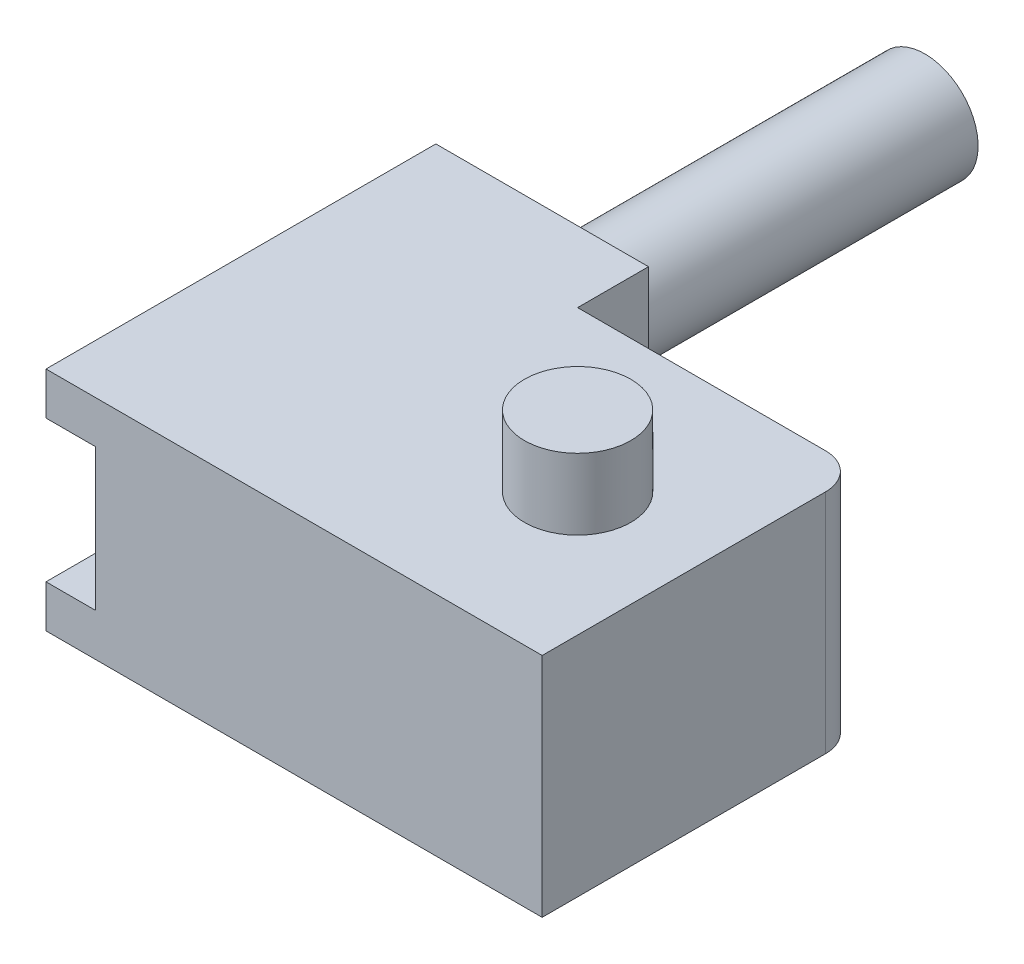
ISO-10303-21;
HEADER;
FILE_DESCRIPTION(('STEP AP214'),'2;1');
FILE_NAME('part.step','',(''),(''),'','','');
FILE_SCHEMA(('AUTOMOTIVE_DESIGN { 1 0 10303 214 1 1 1 1 }'));
ENDSEC;
DATA;
#1=APPLICATION_CONTEXT('core data for automotive mechanical design processes');
#2=APPLICATION_PROTOCOL_DEFINITION('international standard','automotive_design',2000,#1);
#3=PRODUCT_CONTEXT('',#1,'mechanical');
#4=PRODUCT('Part','Part','',(#3));
#5=PRODUCT_RELATED_PRODUCT_CATEGORY('part','',(#4));
#6=PRODUCT_DEFINITION_FORMATION('','',#4);
#7=PRODUCT_DEFINITION_CONTEXT('part definition',#1,'design');
#8=PRODUCT_DEFINITION('design','',#6,#7);
#9=PRODUCT_DEFINITION_SHAPE('','',#8);
#10=(LENGTH_UNIT() NAMED_UNIT(*) SI_UNIT(.MILLI.,.METRE.));
#11=(NAMED_UNIT(*) PLANE_ANGLE_UNIT() SI_UNIT($,.RADIAN.));
#12=(NAMED_UNIT(*) SI_UNIT($,.STERADIAN.) SOLID_ANGLE_UNIT());
#13=UNCERTAINTY_MEASURE_WITH_UNIT(LENGTH_MEASURE(1.E-05),#10,'distance_accuracy_value','');
#14=(GEOMETRIC_REPRESENTATION_CONTEXT(3) GLOBAL_UNCERTAINTY_ASSIGNED_CONTEXT((#13)) GLOBAL_UNIT_ASSIGNED_CONTEXT((#10,
#11,#12)) REPRESENTATION_CONTEXT('',''));
#15=CARTESIAN_POINT('',(0.,0.,0.));
#16=DIRECTION('',(0.,0.,1.));
#17=DIRECTION('',(1.,0.,0.));
#18=AXIS2_PLACEMENT_3D('',#15,#16,#17);
#19=CARTESIAN_POINT('',(52.5,-30.,22.5));
#20=DIRECTION('',(0.,1.,0.));
#21=DIRECTION('',(0.,0.,1.));
#22=AXIS2_PLACEMENT_3D('',#19,#20,#21);
#23=CYLINDRICAL_SURFACE('',#22,7.5);
#24=CARTESIAN_POINT('',(52.5,3.99999999999999,22.5));
#25=DIRECTION('',(0.,1.,0.));
#26=DIRECTION('',(-1.,0.,0.));
#27=AXIS2_PLACEMENT_3D('',#24,#25,#26);
#28=CIRCLE('',#27,7.5);
#29=CARTESIAN_POINT('',(45.,3.99999999999999,22.5));
#30=VERTEX_POINT('',#29);
#31=EDGE_CURVE('E205',#30,#30,#28,.T.);
#32=ORIENTED_EDGE('',*,*,#31,.F.);
#33=EDGE_LOOP('',(#32));
#34=FACE_BOUND('',#33,.T.);
#35=CARTESIAN_POINT('',(52.5,-6.,22.5));
#36=DIRECTION('',(0.,-1.,0.));
#37=DIRECTION('',(0.,0.,-1.));
#38=AXIS2_PLACEMENT_3D('',#35,#36,#37);
#39=CIRCLE('',#38,7.5);
#40=CARTESIAN_POINT('',(52.5,-6.,15.));
#41=VERTEX_POINT('',#40);
#42=EDGE_CURVE('E362',#41,#41,#39,.F.);
#43=ORIENTED_EDGE('',*,*,#42,.T.);
#44=EDGE_LOOP('',(#43));
#45=FACE_BOUND('',#44,.T.);
#46=ADVANCED_FACE('F33',(#34,#45),#23,.T.);
#47=CARTESIAN_POINT('',(47.5,0.,39.));
#48=DIRECTION('',(-1.,0.,0.));
#49=DIRECTION('',(0.,0.,1.));
#50=AXIS2_PLACEMENT_3D('',#47,#48,#49);
#51=PLANE('',#50);
#52=DIRECTION('',(0.,1.,0.));
#53=VECTOR('',#52,1.);
#54=CARTESIAN_POINT('',(47.5,-30.,28.0901699437495));
#55=LINE('',#54,#53);
#56=CARTESIAN_POINT('',(47.5,9.99999999999999,28.0901699437495));
#57=VERTEX_POINT('',#56);
#58=CARTESIAN_POINT('',(47.5,30.,28.0901699437495));
#59=VERTEX_POINT('',#58);
#60=EDGE_CURVE('E199',#57,#59,#55,.T.);
#61=ORIENTED_EDGE('',*,*,#60,.F.);
#62=DIRECTION('',(0.,0.,-1.));
#63=VECTOR('',#62,1.);
#64=CARTESIAN_POINT('',(47.5,9.99999999999999,39.));
#65=LINE('',#64,#63);
#66=CARTESIAN_POINT('',(47.5,9.99999999999999,39.));
#67=VERTEX_POINT('',#66);
#68=EDGE_CURVE('E185',#67,#57,#65,.T.);
#69=ORIENTED_EDGE('',*,*,#68,.F.);
#70=DIRECTION('',(0.,1.,0.));
#71=VECTOR('',#70,1.);
#72=CARTESIAN_POINT('',(47.5,0.,39.));
#73=LINE('',#72,#71);
#74=CARTESIAN_POINT('',(47.5,30.,39.));
#75=VERTEX_POINT('',#74);
#76=EDGE_CURVE('E235',#67,#75,#73,.T.);
#77=ORIENTED_EDGE('',*,*,#76,.T.);
#78=DIRECTION('',(0.,0.,-1.));
#79=VECTOR('',#78,1.);
#80=CARTESIAN_POINT('',(47.5,30.,39.));
#81=LINE('',#80,#79);
#82=EDGE_CURVE('E201',#75,#59,#81,.T.);
#83=ORIENTED_EDGE('',*,*,#82,.T.);
#84=EDGE_LOOP('',(#61,#69,#77,#83));
#85=FACE_BOUND('',#84,.T.);
#86=ADVANCED_FACE('F200',(#85),#51,.T.);
#87=CARTESIAN_POINT('',(65.,40.,5.));
#88=DIRECTION('',(0.,-1.,0.));
#89=DIRECTION('',(0.,0.,-1.));
#90=AXIS2_PLACEMENT_3D('',#87,#88,#89);
#91=CYLINDRICAL_SURFACE('',#90,5.);
#92=DIRECTION('',(0.,1.,0.));
#93=VECTOR('',#92,1.);
#94=CARTESIAN_POINT('',(65.,40.,0.));
#95=LINE('',#94,#93);
#96=CARTESIAN_POINT('',(65.,36.,0.));
#97=VERTEX_POINT('',#96);
#98=CARTESIAN_POINT('',(65.,3.99999999999999,0.));
#99=VERTEX_POINT('',#98);
#100=EDGE_CURVE('E213',#97,#99,#95,.F.);
#101=ORIENTED_EDGE('',*,*,#100,.F.);
#102=CARTESIAN_POINT('',(65.,36.,5.));
#103=DIRECTION('',(0.,1.,0.));
#104=DIRECTION('',(-1.,0.,0.));
#105=AXIS2_PLACEMENT_3D('',#102,#103,#104);
#106=CIRCLE('',#105,5.);
#107=CARTESIAN_POINT('',(70.,36.,5.00000000000001));
#108=VERTEX_POINT('',#107);
#109=EDGE_CURVE('E212',#97,#108,#106,.F.);
#110=ORIENTED_EDGE('',*,*,#109,.T.);
#111=DIRECTION('',(0.,1.,0.));
#112=VECTOR('',#111,1.);
#113=CARTESIAN_POINT('',(70.,40.,5.));
#114=LINE('',#113,#112);
#115=CARTESIAN_POINT('',(70.,3.99999999999999,5.00000000000001));
#116=VERTEX_POINT('',#115);
#117=EDGE_CURVE('E218',#116,#108,#114,.T.);
#118=ORIENTED_EDGE('',*,*,#117,.F.);
#119=CARTESIAN_POINT('',(65.,3.99999999999999,5.));
#120=DIRECTION('',(0.,1.,0.));
#121=DIRECTION('',(-1.,0.,0.));
#122=AXIS2_PLACEMENT_3D('',#119,#120,#121);
#123=CIRCLE('',#122,5.);
#124=EDGE_CURVE('E340',#99,#116,#123,.F.);
#125=ORIENTED_EDGE('',*,*,#124,.F.);
#126=EDGE_LOOP('',(#101,#110,#118,#125));
#127=FACE_BOUND('',#126,.T.);
#128=ADVANCED_FACE('F461',(#127),#91,.T.);
#129=CARTESIAN_POINT('',(0.,0.,0.));
#130=DIRECTION('',(0.,0.,-1.));
#131=DIRECTION('',(-1.,0.,0.));
#132=AXIS2_PLACEMENT_3D('',#129,#130,#131);
#133=PLANE('',#132);
#134=DIRECTION('',(0.,-1.,0.));
#135=VECTOR('',#134,1.);
#136=CARTESIAN_POINT('',(30.,40.,0.));
#137=LINE('',#136,#135);
#138=CARTESIAN_POINT('',(30.,36.,0.));
#139=VERTEX_POINT('',#138);
#140=CARTESIAN_POINT('',(30.,30.,0.));
#141=VERTEX_POINT('',#140);
#142=EDGE_CURVE('E230',#139,#141,#137,.T.);
#143=ORIENTED_EDGE('',*,*,#142,.F.);
#144=DIRECTION('',(1.,0.,0.));
#145=VECTOR('',#144,1.);
#146=CARTESIAN_POINT('',(0.,36.,0.));
#147=LINE('',#146,#145);
#148=EDGE_CURVE('E217',#139,#97,#147,.T.);
#149=ORIENTED_EDGE('',*,*,#148,.T.);
#150=ORIENTED_EDGE('',*,*,#100,.T.);
#151=DIRECTION('',(1.,0.,0.));
#152=VECTOR('',#151,1.);
#153=CARTESIAN_POINT('',(0.,4.,0.));
#154=LINE('',#153,#152);
#155=CARTESIAN_POINT('',(30.,4.,0.));
#156=VERTEX_POINT('',#155);
#157=EDGE_CURVE('E352',#156,#99,#154,.T.);
#158=ORIENTED_EDGE('',*,*,#157,.F.);
#159=CARTESIAN_POINT('',(30.,10.,0.));
#160=VERTEX_POINT('',#159);
#161=EDGE_CURVE('E321',#160,#156,#137,.T.);
#162=ORIENTED_EDGE('',*,*,#161,.F.);
#163=DIRECTION('',(1.,0.,0.));
#164=VECTOR('',#163,1.);
#165=CARTESIAN_POINT('',(0.,10.,0.));
#166=LINE('',#165,#164);
#167=CARTESIAN_POINT('',(54.5,10.,0.));
#168=VERTEX_POINT('',#167);
#169=EDGE_CURVE('E216',#160,#168,#166,.T.);
#170=ORIENTED_EDGE('',*,*,#169,.T.);
#171=DIRECTION('',(0.,1.,0.));
#172=VECTOR('',#171,1.);
#173=CARTESIAN_POINT('',(54.5,10.,0.));
#174=LINE('',#173,#172);
#175=CARTESIAN_POINT('',(54.5,30.,0.));
#176=VERTEX_POINT('',#175);
#177=EDGE_CURVE('E272',#168,#176,#174,.T.);
#178=ORIENTED_EDGE('',*,*,#177,.T.);
#179=DIRECTION('',(1.,0.,0.));
#180=VECTOR('',#179,1.);
#181=CARTESIAN_POINT('',(0.,30.,0.));
#182=LINE('',#181,#180);
#183=EDGE_CURVE('E246',#141,#176,#182,.T.);
#184=ORIENTED_EDGE('',*,*,#183,.F.);
#185=EDGE_LOOP('',(#143,#149,#150,#158,#162,#170,#178,#184));
#186=FACE_BOUND('',#185,.T.);
#187=ADVANCED_FACE('F411',(#186),#133,.T.);
#188=CARTESIAN_POINT('',(70.,40.,45.));
#189=DIRECTION('',(-1.,0.,0.));
#190=DIRECTION('',(0.,0.,1.));
#191=AXIS2_PLACEMENT_3D('',#188,#189,#190);
#192=PLANE('',#191);
#193=DIRECTION('',(0.,0.,-1.));
#194=VECTOR('',#193,1.);
#195=CARTESIAN_POINT('',(70.,36.,45.));
#196=LINE('',#195,#194);
#197=CARTESIAN_POINT('',(70.,36.,45.));
#198=VERTEX_POINT('',#197);
#199=EDGE_CURVE('E339',#198,#108,#196,.T.);
#200=ORIENTED_EDGE('',*,*,#199,.F.);
#201=DIRECTION('',(0.,1.,0.));
#202=VECTOR('',#201,1.);
#203=CARTESIAN_POINT('',(70.,40.,45.));
#204=LINE('',#203,#202);
#205=CARTESIAN_POINT('',(70.,4.,45.));
#206=VERTEX_POINT('',#205);
#207=EDGE_CURVE('E228',#206,#198,#204,.T.);
#208=ORIENTED_EDGE('',*,*,#207,.F.);
#209=DIRECTION('',(0.,0.,-1.));
#210=VECTOR('',#209,1.);
#211=CARTESIAN_POINT('',(70.,4.,45.));
#212=LINE('',#211,#210);
#213=EDGE_CURVE('E222',#206,#116,#212,.T.);
#214=ORIENTED_EDGE('',*,*,#213,.T.);
#215=ORIENTED_EDGE('',*,*,#117,.T.);
#216=EDGE_LOOP('',(#200,#208,#214,#215));
#217=FACE_BOUND('',#216,.T.);
#218=ADVANCED_FACE('F386',(#217),#192,.F.);
#219=CARTESIAN_POINT('',(0.,0.,45.));
#220=DIRECTION('',(1.,0.,0.));
#221=DIRECTION('',(0.,0.,-1.));
#222=AXIS2_PLACEMENT_3D('',#219,#220,#221);
#223=PLANE('',#222);
#224=DIRECTION('',(0.,1.,0.));
#225=VECTOR('',#224,1.);
#226=CARTESIAN_POINT('',(0.,0.,0.));
#227=LINE('',#226,#225);
#228=CARTESIAN_POINT('',(0.,10.,0.));
#229=VERTEX_POINT('',#228);
#230=CARTESIAN_POINT('',(0.,30.,0.));
#231=VERTEX_POINT('',#230);
#232=EDGE_CURVE('E221',#229,#231,#227,.T.);
#233=ORIENTED_EDGE('',*,*,#232,.T.);
#234=DIRECTION('',(0.,0.,-1.));
#235=VECTOR('',#234,1.);
#236=CARTESIAN_POINT('',(0.,30.,12.));
#237=LINE('',#236,#235);
#238=CARTESIAN_POINT('',(0.,30.,12.));
#239=VERTEX_POINT('',#238);
#240=EDGE_CURVE('E239',#239,#231,#237,.T.);
#241=ORIENTED_EDGE('',*,*,#240,.F.);
#242=DIRECTION('',(0.,1.,0.));
#243=VECTOR('',#242,1.);
#244=CARTESIAN_POINT('',(0.,10.,12.));
#245=LINE('',#244,#243);
#246=CARTESIAN_POINT('',(0.,10.,12.));
#247=VERTEX_POINT('',#246);
#248=EDGE_CURVE('E284',#247,#239,#245,.T.);
#249=ORIENTED_EDGE('',*,*,#248,.F.);
#250=DIRECTION('',(0.,0.,-1.));
#251=VECTOR('',#250,1.);
#252=CARTESIAN_POINT('',(0.,10.,12.));
#253=LINE('',#252,#251);
#254=EDGE_CURVE('E279',#247,#229,#253,.T.);
#255=ORIENTED_EDGE('',*,*,#254,.T.);
#256=EDGE_LOOP('',(#233,#241,#249,#255));
#257=FACE_BOUND('',#256,.T.);
#258=DIRECTION('',(0.,0.,-1.));
#259=VECTOR('',#258,1.);
#260=CARTESIAN_POINT('',(0.,36.,50.));
#261=LINE('',#260,#259);
#262=CARTESIAN_POINT('',(0.,36.,45.));
#263=VERTEX_POINT('',#262);
#264=CARTESIAN_POINT('',(0.,36.,-10.));
#265=VERTEX_POINT('',#264);
#266=EDGE_CURVE('E226',#263,#265,#261,.T.);
#267=ORIENTED_EDGE('',*,*,#266,.T.);
#268=DIRECTION('',(0.,1.,0.));
#269=VECTOR('',#268,1.);
#270=CARTESIAN_POINT('',(0.,0.,-10.));
#271=LINE('',#270,#269);
#272=CARTESIAN_POINT('',(0.,4.,-10.));
#273=VERTEX_POINT('',#272);
#274=EDGE_CURVE('E327',#273,#265,#271,.T.);
#275=ORIENTED_EDGE('',*,*,#274,.F.);
#276=DIRECTION('',(0.,0.,-1.));
#277=VECTOR('',#276,1.);
#278=CARTESIAN_POINT('',(0.,4.,50.));
#279=LINE('',#278,#277);
#280=CARTESIAN_POINT('',(0.,4.,45.));
#281=VERTEX_POINT('',#280);
#282=EDGE_CURVE('E336',#281,#273,#279,.T.);
#283=ORIENTED_EDGE('',*,*,#282,.F.);
#284=DIRECTION('',(0.,-1.,0.));
#285=VECTOR('',#284,1.);
#286=CARTESIAN_POINT('',(0.,0.,45.));
#287=LINE('',#286,#285);
#288=CARTESIAN_POINT('',(0.,10.,45.));
#289=VERTEX_POINT('',#288);
#290=EDGE_CURVE('E227',#289,#281,#287,.T.);
#291=ORIENTED_EDGE('',*,*,#290,.F.);
#292=DIRECTION('',(0.,0.,1.));
#293=VECTOR('',#292,1.);
#294=CARTESIAN_POINT('',(0.,10.,25.));
#295=LINE('',#294,#293);
#296=CARTESIAN_POINT('',(0.,10.,25.));
#297=VERTEX_POINT('',#296);
#298=EDGE_CURVE('E260',#297,#289,#295,.T.);
#299=ORIENTED_EDGE('',*,*,#298,.F.);
#300=DIRECTION('',(0.,-1.,0.));
#301=VECTOR('',#300,1.);
#302=CARTESIAN_POINT('',(0.,10.,25.));
#303=LINE('',#302,#301);
#304=CARTESIAN_POINT('',(0.,30.,25.));
#305=VERTEX_POINT('',#304);
#306=EDGE_CURVE('E287',#305,#297,#303,.T.);
#307=ORIENTED_EDGE('',*,*,#306,.F.);
#308=DIRECTION('',(0.,0.,-1.));
#309=VECTOR('',#308,1.);
#310=CARTESIAN_POINT('',(0.,30.,45.));
#311=LINE('',#310,#309);
#312=CARTESIAN_POINT('',(0.,30.,45.));
#313=VERTEX_POINT('',#312);
#314=EDGE_CURVE('E240',#313,#305,#311,.T.);
#315=ORIENTED_EDGE('',*,*,#314,.F.);
#316=EDGE_CURVE('E223',#263,#313,#287,.T.);
#317=ORIENTED_EDGE('',*,*,#316,.F.);
#318=EDGE_LOOP('',(#267,#275,#283,#291,#299,#307,#315,#317));
#319=FACE_BOUND('',#318,.T.);
#320=ADVANCED_FACE('F396',(#257,#319),#223,.F.);
#321=CARTESIAN_POINT('',(0.,0.,45.));
#322=DIRECTION('',(0.,0.,-1.));
#323=DIRECTION('',(-1.,0.,0.));
#324=AXIS2_PLACEMENT_3D('',#321,#322,#323);
#325=PLANE('',#324);
#326=DIRECTION('',(1.,0.,0.));
#327=VECTOR('',#326,1.);
#328=CARTESIAN_POINT('',(0.,36.,45.));
#329=LINE('',#328,#327);
#330=EDGE_CURVE('E337',#263,#198,#329,.T.);
#331=ORIENTED_EDGE('',*,*,#330,.F.);
#332=ORIENTED_EDGE('',*,*,#316,.T.);
#333=DIRECTION('',(-1.,0.,0.));
#334=VECTOR('',#333,1.);
#335=CARTESIAN_POINT('',(7.,30.,45.));
#336=LINE('',#335,#334);
#337=CARTESIAN_POINT('',(7.,30.,45.));
#338=VERTEX_POINT('',#337);
#339=EDGE_CURVE('E298',#338,#313,#336,.T.);
#340=ORIENTED_EDGE('',*,*,#339,.F.);
#341=DIRECTION('',(0.,1.,0.));
#342=VECTOR('',#341,1.);
#343=CARTESIAN_POINT('',(7.,10.,45.));
#344=LINE('',#343,#342);
#345=CARTESIAN_POINT('',(7.,10.,45.));
#346=VERTEX_POINT('',#345);
#347=EDGE_CURVE('E314',#346,#338,#344,.T.);
#348=ORIENTED_EDGE('',*,*,#347,.F.);
#349=DIRECTION('',(-1.,0.,0.));
#350=VECTOR('',#349,1.);
#351=CARTESIAN_POINT('',(7.,10.,45.));
#352=LINE('',#351,#350);
#353=EDGE_CURVE('E225',#346,#289,#352,.T.);
#354=ORIENTED_EDGE('',*,*,#353,.T.);
#355=ORIENTED_EDGE('',*,*,#290,.T.);
#356=DIRECTION('',(1.,0.,0.));
#357=VECTOR('',#356,1.);
#358=CARTESIAN_POINT('',(0.,4.,45.));
#359=LINE('',#358,#357);
#360=EDGE_CURVE('E231',#281,#206,#359,.T.);
#361=ORIENTED_EDGE('',*,*,#360,.T.);
#362=ORIENTED_EDGE('',*,*,#207,.T.);
#363=EDGE_LOOP('',(#331,#332,#340,#348,#354,#355,#361,#362));
#364=FACE_BOUND('',#363,.T.);
#365=ADVANCED_FACE('F388',(#364),#325,.F.);
#366=CARTESIAN_POINT('',(30.,40.,-10.));
#367=DIRECTION('',(-1.,0.,0.));
#368=DIRECTION('',(0.,-1.,0.));
#369=AXIS2_PLACEMENT_3D('',#366,#367,#368);
#370=PLANE('',#369);
#371=DIRECTION('',(0.,0.,-1.));
#372=VECTOR('',#371,1.);
#373=CARTESIAN_POINT('',(30.,36.,-10.));
#374=LINE('',#373,#372);
#375=CARTESIAN_POINT('',(30.,36.,-10.));
#376=VERTEX_POINT('',#375);
#377=EDGE_CURVE('E42',#139,#376,#374,.T.);
#378=ORIENTED_EDGE('',*,*,#377,.F.);
#379=ORIENTED_EDGE('',*,*,#142,.T.);
#380=EDGE_CURVE('E320',#141,#160,#137,.T.);
#381=ORIENTED_EDGE('',*,*,#380,.T.);
#382=ORIENTED_EDGE('',*,*,#161,.T.);
#383=DIRECTION('',(0.,0.,-1.));
#384=VECTOR('',#383,1.);
#385=CARTESIAN_POINT('',(30.,4.,-10.));
#386=LINE('',#385,#384);
#387=CARTESIAN_POINT('',(30.,4.,-10.));
#388=VERTEX_POINT('',#387);
#389=EDGE_CURVE('E330',#156,#388,#386,.T.);
#390=ORIENTED_EDGE('',*,*,#389,.T.);
#391=DIRECTION('',(0.,-1.,0.));
#392=VECTOR('',#391,1.);
#393=CARTESIAN_POINT('',(30.,40.,-10.));
#394=LINE('',#393,#392);
#395=EDGE_CURVE('E312',#376,#388,#394,.T.);
#396=ORIENTED_EDGE('',*,*,#395,.F.);
#397=EDGE_LOOP('',(#378,#379,#381,#382,#390,#396));
#398=FACE_BOUND('',#397,.T.);
#399=ADVANCED_FACE('F405',(#398),#370,.F.);
#400=CARTESIAN_POINT('',(0.,0.,-10.));
#401=DIRECTION('',(0.,0.,-1.));
#402=DIRECTION('',(-1.,0.,0.));
#403=AXIS2_PLACEMENT_3D('',#400,#401,#402);
#404=PLANE('',#403);
#405=CARTESIAN_POINT('',(15.,20.,-10.));
#406=DIRECTION('',(0.,0.,-1.));
#407=DIRECTION('',(-1.,0.,0.));
#408=AXIS2_PLACEMENT_3D('',#405,#406,#407);
#409=CIRCLE('',#408,7.5);
#410=CARTESIAN_POINT('',(7.5,20.,-10.));
#411=VERTEX_POINT('',#410);
#412=EDGE_CURVE('E250',#411,#411,#409,.T.);
#413=ORIENTED_EDGE('',*,*,#412,.F.);
#414=EDGE_LOOP('',(#413));
#415=FACE_BOUND('',#414,.T.);
#416=ORIENTED_EDGE('',*,*,#274,.T.);
#417=DIRECTION('',(1.,0.,0.));
#418=VECTOR('',#417,1.);
#419=CARTESIAN_POINT('',(0.,36.,-10.));
#420=LINE('',#419,#418);
#421=EDGE_CURVE('E326',#265,#376,#420,.T.);
#422=ORIENTED_EDGE('',*,*,#421,.T.);
#423=ORIENTED_EDGE('',*,*,#395,.T.);
#424=DIRECTION('',(1.,0.,0.));
#425=VECTOR('',#424,1.);
#426=CARTESIAN_POINT('',(0.,4.,-10.));
#427=LINE('',#426,#425);
#428=EDGE_CURVE('E354',#273,#388,#427,.T.);
#429=ORIENTED_EDGE('',*,*,#428,.F.);
#430=EDGE_LOOP('',(#416,#422,#423,#429));
#431=FACE_BOUND('',#430,.T.);
#432=ADVANCED_FACE('F399',(#415,#431),#404,.T.);
#433=CARTESIAN_POINT('',(7.,0.,39.));
#434=DIRECTION('',(1.,0.,0.));
#435=DIRECTION('',(0.,1.,0.));
#436=AXIS2_PLACEMENT_3D('',#433,#434,#435);
#437=PLANE('',#436);
#438=DIRECTION('',(0.,-1.,0.));
#439=VECTOR('',#438,1.);
#440=CARTESIAN_POINT('',(7.,10.,25.));
#441=LINE('',#440,#439);
#442=CARTESIAN_POINT('',(7.,30.,25.));
#443=VERTEX_POINT('',#442);
#444=CARTESIAN_POINT('',(7.,10.,25.));
#445=VERTEX_POINT('',#444);
#446=EDGE_CURVE('E236',#443,#445,#441,.T.);
#447=ORIENTED_EDGE('',*,*,#446,.T.);
#448=DIRECTION('',(0.,0.,-1.));
#449=VECTOR('',#448,1.);
#450=CARTESIAN_POINT('',(7.,10.,39.));
#451=LINE('',#450,#449);
#452=CARTESIAN_POINT('',(7.,10.,12.));
#453=VERTEX_POINT('',#452);
#454=EDGE_CURVE('E233',#445,#453,#451,.T.);
#455=ORIENTED_EDGE('',*,*,#454,.T.);
#456=DIRECTION('',(0.,-1.,0.));
#457=VECTOR('',#456,1.);
#458=CARTESIAN_POINT('',(7.,30.,12.));
#459=LINE('',#458,#457);
#460=CARTESIAN_POINT('',(7.,30.,12.));
#461=VERTEX_POINT('',#460);
#462=EDGE_CURVE('E291',#461,#453,#459,.T.);
#463=ORIENTED_EDGE('',*,*,#462,.F.);
#464=DIRECTION('',(0.,0.,-1.));
#465=VECTOR('',#464,1.);
#466=CARTESIAN_POINT('',(7.,30.,39.));
#467=LINE('',#466,#465);
#468=EDGE_CURVE('E237',#443,#461,#467,.T.);
#469=ORIENTED_EDGE('',*,*,#468,.F.);
#470=EDGE_LOOP('',(#447,#455,#463,#469));
#471=FACE_BOUND('',#470,.T.);
#472=ADVANCED_FACE('F428',(#471),#437,.T.);
#473=DIRECTION('',(0.,1.,0.));
#474=VECTOR('',#473,1.);
#475=CARTESIAN_POINT('',(47.5,-30.,16.9098300562505));
#476=LINE('',#475,#474);
#477=CARTESIAN_POINT('',(47.5,30.,16.9098300562505));
#478=VERTEX_POINT('',#477);
#479=CARTESIAN_POINT('',(47.5,9.99999999999999,16.9098300562505));
#480=VERTEX_POINT('',#479);
#481=EDGE_CURVE('E50',#478,#480,#476,.F.);
#482=ORIENTED_EDGE('',*,*,#481,.F.);
#483=CARTESIAN_POINT('',(47.5,30.,12.));
#484=VERTEX_POINT('',#483);
#485=EDGE_CURVE('E243',#478,#484,#81,.T.);
#486=ORIENTED_EDGE('',*,*,#485,.T.);
#487=DIRECTION('',(0.,1.,0.));
#488=VECTOR('',#487,1.);
#489=CARTESIAN_POINT('',(47.5,10.,12.));
#490=LINE('',#489,#488);
#491=CARTESIAN_POINT('',(47.5,10.,12.));
#492=VERTEX_POINT('',#491);
#493=EDGE_CURVE('E265',#492,#484,#490,.T.);
#494=ORIENTED_EDGE('',*,*,#493,.F.);
#495=EDGE_CURVE('E196',#480,#492,#65,.T.);
#496=ORIENTED_EDGE('',*,*,#495,.F.);
#497=EDGE_LOOP('',(#482,#486,#494,#496));
#498=FACE_BOUND('',#497,.T.);
#499=ADVANCED_FACE('F463',(#498),#51,.T.);
#500=CARTESIAN_POINT('',(0.,30.,39.));
#501=DIRECTION('',(0.,1.,0.));
#502=DIRECTION('',(-1.,0.,0.));
#503=AXIS2_PLACEMENT_3D('',#500,#501,#502);
#504=PLANE('',#503);
#505=ORIENTED_EDGE('',*,*,#485,.F.);
#506=CARTESIAN_POINT('',(52.5,30.,22.5));
#507=DIRECTION('',(0.,1.,0.));
#508=DIRECTION('',(-1.,0.,0.));
#509=AXIS2_PLACEMENT_3D('',#506,#507,#508);
#510=CIRCLE('',#509,7.5);
#511=EDGE_CURVE('E57',#478,#59,#510,.T.);
#512=ORIENTED_EDGE('',*,*,#511,.T.);
#513=ORIENTED_EDGE('',*,*,#82,.F.);
#514=DIRECTION('',(1.,0.,0.));
#515=VECTOR('',#514,1.);
#516=CARTESIAN_POINT('',(0.,30.,39.));
#517=LINE('',#516,#515);
#518=CARTESIAN_POINT('',(7.,30.,39.));
#519=VERTEX_POINT('',#518);
#520=EDGE_CURVE('E252',#519,#75,#517,.T.);
#521=ORIENTED_EDGE('',*,*,#520,.F.);
#522=DIRECTION('',(0.,0.,-1.));
#523=VECTOR('',#522,1.);
#524=CARTESIAN_POINT('',(7.,30.,45.));
#525=LINE('',#524,#523);
#526=EDGE_CURVE('E258',#338,#519,#525,.T.);
#527=ORIENTED_EDGE('',*,*,#526,.F.);
#528=ORIENTED_EDGE('',*,*,#339,.T.);
#529=ORIENTED_EDGE('',*,*,#314,.T.);
#530=DIRECTION('',(-1.,0.,0.));
#531=VECTOR('',#530,1.);
#532=CARTESIAN_POINT('',(7.,30.,25.));
#533=LINE('',#532,#531);
#534=EDGE_CURVE('E301',#443,#305,#533,.T.);
#535=ORIENTED_EDGE('',*,*,#534,.F.);
#536=ORIENTED_EDGE('',*,*,#468,.T.);
#537=DIRECTION('',(1.,0.,0.));
#538=VECTOR('',#537,1.);
#539=CARTESIAN_POINT('',(0.,30.,12.));
#540=LINE('',#539,#538);
#541=EDGE_CURVE('E271',#239,#461,#540,.T.);
#542=ORIENTED_EDGE('',*,*,#541,.F.);
#543=ORIENTED_EDGE('',*,*,#240,.T.);
#544=EDGE_CURVE('E242',#231,#141,#182,.T.);
#545=ORIENTED_EDGE('',*,*,#544,.T.);
#546=ORIENTED_EDGE('',*,*,#183,.T.);
#547=DIRECTION('',(0.,0.,-1.));
#548=VECTOR('',#547,1.);
#549=CARTESIAN_POINT('',(54.5,30.,12.));
#550=LINE('',#549,#548);
#551=CARTESIAN_POINT('',(54.5,30.,12.));
#552=VERTEX_POINT('',#551);
#553=EDGE_CURVE('E266',#552,#176,#550,.T.);
#554=ORIENTED_EDGE('',*,*,#553,.F.);
#555=DIRECTION('',(1.,0.,0.));
#556=VECTOR('',#555,1.);
#557=CARTESIAN_POINT('',(47.5,30.,12.));
#558=LINE('',#557,#556);
#559=EDGE_CURVE('E262',#484,#552,#558,.T.);
#560=ORIENTED_EDGE('',*,*,#559,.F.);
#561=EDGE_LOOP('',(#505,#512,#513,#521,#527,#528,#529,#535,#536,#542,#543,#545,#546,#554,#560));
#562=FACE_BOUND('',#561,.T.);
#563=ADVANCED_FACE('F434',(#562),#504,.F.);
#564=CARTESIAN_POINT('',(0.,10.,39.));
#565=DIRECTION('',(0.,1.,0.));
#566=DIRECTION('',(-1.,0.,0.));
#567=AXIS2_PLACEMENT_3D('',#564,#565,#566);
#568=PLANE('',#567);
#569=CARTESIAN_POINT('',(52.5,9.99999999999999,22.5));
#570=DIRECTION('',(0.,1.,0.));
#571=DIRECTION('',(-1.,0.,0.));
#572=AXIS2_PLACEMENT_3D('',#569,#570,#571);
#573=CIRCLE('',#572,7.5);
#574=EDGE_CURVE('E189',#480,#57,#573,.T.);
#575=ORIENTED_EDGE('',*,*,#574,.F.);
#576=ORIENTED_EDGE('',*,*,#495,.T.);
#577=DIRECTION('',(1.,0.,0.));
#578=VECTOR('',#577,1.);
#579=CARTESIAN_POINT('',(47.5,10.,12.));
#580=LINE('',#579,#578);
#581=CARTESIAN_POINT('',(54.5,10.,12.));
#582=VERTEX_POINT('',#581);
#583=EDGE_CURVE('E195',#492,#582,#580,.T.);
#584=ORIENTED_EDGE('',*,*,#583,.T.);
#585=DIRECTION('',(0.,0.,-1.));
#586=VECTOR('',#585,1.);
#587=CARTESIAN_POINT('',(54.5,10.,12.));
#588=LINE('',#587,#586);
#589=EDGE_CURVE('E256',#582,#168,#588,.T.);
#590=ORIENTED_EDGE('',*,*,#589,.T.);
#591=ORIENTED_EDGE('',*,*,#169,.F.);
#592=EDGE_CURVE('E247',#229,#160,#166,.T.);
#593=ORIENTED_EDGE('',*,*,#592,.F.);
#594=ORIENTED_EDGE('',*,*,#254,.F.);
#595=DIRECTION('',(-1.,0.,0.));
#596=VECTOR('',#595,1.);
#597=CARTESIAN_POINT('',(7.,10.,12.));
#598=LINE('',#597,#596);
#599=EDGE_CURVE('E288',#453,#247,#598,.T.);
#600=ORIENTED_EDGE('',*,*,#599,.F.);
#601=ORIENTED_EDGE('',*,*,#454,.F.);
#602=DIRECTION('',(-1.,0.,0.));
#603=VECTOR('',#602,1.);
#604=CARTESIAN_POINT('',(7.,10.,25.));
#605=LINE('',#604,#603);
#606=EDGE_CURVE('E283',#445,#297,#605,.T.);
#607=ORIENTED_EDGE('',*,*,#606,.T.);
#608=ORIENTED_EDGE('',*,*,#298,.T.);
#609=ORIENTED_EDGE('',*,*,#353,.F.);
#610=DIRECTION('',(0.,0.,1.));
#611=VECTOR('',#610,1.);
#612=CARTESIAN_POINT('',(7.,10.,25.));
#613=LINE('',#612,#611);
#614=CARTESIAN_POINT('',(7.,10.,39.));
#615=VERTEX_POINT('',#614);
#616=EDGE_CURVE('E303',#615,#346,#613,.T.);
#617=ORIENTED_EDGE('',*,*,#616,.F.);
#618=DIRECTION('',(1.,0.,0.));
#619=VECTOR('',#618,1.);
#620=CARTESIAN_POINT('',(0.,10.,39.));
#621=LINE('',#620,#619);
#622=EDGE_CURVE('E192',#615,#67,#621,.T.);
#623=ORIENTED_EDGE('',*,*,#622,.T.);
#624=ORIENTED_EDGE('',*,*,#68,.T.);
#625=EDGE_LOOP('',(#575,#576,#584,#590,#591,#593,#594,#600,#601,#607,#608,#609,#617,#623,#624));
#626=FACE_BOUND('',#625,.T.);
#627=ADVANCED_FACE('F187',(#626),#568,.T.);
#628=CARTESIAN_POINT('',(0.,0.,39.));
#629=DIRECTION('',(0.,0.,-1.));
#630=DIRECTION('',(-1.,0.,0.));
#631=AXIS2_PLACEMENT_3D('',#628,#629,#630);
#632=PLANE('',#631);
#633=ORIENTED_EDGE('',*,*,#76,.F.);
#634=ORIENTED_EDGE('',*,*,#622,.F.);
#635=DIRECTION('',(0.,-1.,0.));
#636=VECTOR('',#635,1.);
#637=CARTESIAN_POINT('',(7.,0.,39.));
#638=LINE('',#637,#636);
#639=EDGE_CURVE('E251',#519,#615,#638,.T.);
#640=ORIENTED_EDGE('',*,*,#639,.F.);
#641=ORIENTED_EDGE('',*,*,#520,.T.);
#642=EDGE_LOOP('',(#633,#634,#640,#641));
#643=FACE_BOUND('',#642,.T.);
#644=ADVANCED_FACE('F442',(#643),#632,.T.);
#645=CARTESIAN_POINT('',(54.5,10.,12.));
#646=DIRECTION('',(-1.,0.,0.));
#647=DIRECTION('',(0.,0.,1.));
#648=AXIS2_PLACEMENT_3D('',#645,#646,#647);
#649=PLANE('',#648);
#650=ORIENTED_EDGE('',*,*,#177,.F.);
#651=ORIENTED_EDGE('',*,*,#589,.F.);
#652=DIRECTION('',(0.,1.,0.));
#653=VECTOR('',#652,1.);
#654=CARTESIAN_POINT('',(54.5,10.,12.));
#655=LINE('',#654,#653);
#656=EDGE_CURVE('E255',#582,#552,#655,.T.);
#657=ORIENTED_EDGE('',*,*,#656,.T.);
#658=ORIENTED_EDGE('',*,*,#553,.T.);
#659=EDGE_LOOP('',(#650,#651,#657,#658));
#660=FACE_BOUND('',#659,.T.);
#661=ADVANCED_FACE('F444',(#660),#649,.T.);
#662=CARTESIAN_POINT('',(0.,0.,12.));
#663=DIRECTION('',(0.,0.,1.));
#664=DIRECTION('',(1.,0.,0.));
#665=AXIS2_PLACEMENT_3D('',#662,#663,#664);
#666=PLANE('',#665);
#667=ORIENTED_EDGE('',*,*,#559,.T.);
#668=ORIENTED_EDGE('',*,*,#656,.F.);
#669=ORIENTED_EDGE('',*,*,#583,.F.);
#670=ORIENTED_EDGE('',*,*,#493,.T.);
#671=EDGE_LOOP('',(#667,#668,#669,#670));
#672=FACE_BOUND('',#671,.T.);
#673=ADVANCED_FACE('F450',(#672),#666,.F.);
#674=CARTESIAN_POINT('',(0.,0.,12.));
#675=DIRECTION('',(0.,0.,-1.));
#676=DIRECTION('',(-1.,0.,0.));
#677=AXIS2_PLACEMENT_3D('',#674,#675,#676);
#678=PLANE('',#677);
#679=ORIENTED_EDGE('',*,*,#541,.T.);
#680=ORIENTED_EDGE('',*,*,#462,.T.);
#681=ORIENTED_EDGE('',*,*,#599,.T.);
#682=ORIENTED_EDGE('',*,*,#248,.T.);
#683=EDGE_LOOP('',(#679,#680,#681,#682));
#684=FACE_BOUND('',#683,.T.);
#685=ADVANCED_FACE('F424',(#684),#678,.T.);
#686=CARTESIAN_POINT('',(7.,10.,25.));
#687=DIRECTION('',(0.,0.,-1.));
#688=DIRECTION('',(-1.,0.,0.));
#689=AXIS2_PLACEMENT_3D('',#686,#687,#688);
#690=PLANE('',#689);
#691=ORIENTED_EDGE('',*,*,#306,.T.);
#692=ORIENTED_EDGE('',*,*,#606,.F.);
#693=ORIENTED_EDGE('',*,*,#446,.F.);
#694=ORIENTED_EDGE('',*,*,#534,.T.);
#695=EDGE_LOOP('',(#691,#692,#693,#694));
#696=FACE_BOUND('',#695,.T.);
#697=ADVANCED_FACE('F432',(#696),#690,.F.);
#698=CARTESIAN_POINT('',(7.,0.,0.));
#699=DIRECTION('',(-1.,0.,0.));
#700=DIRECTION('',(0.,0.,1.));
#701=AXIS2_PLACEMENT_3D('',#698,#699,#700);
#702=PLANE('',#701);
#703=ORIENTED_EDGE('',*,*,#616,.T.);
#704=ORIENTED_EDGE('',*,*,#347,.T.);
#705=ORIENTED_EDGE('',*,*,#526,.T.);
#706=ORIENTED_EDGE('',*,*,#639,.T.);
#707=EDGE_LOOP('',(#703,#704,#705,#706));
#708=FACE_BOUND('',#707,.T.);
#709=ADVANCED_FACE('F439',(#708),#702,.T.);
#710=CARTESIAN_POINT('',(0.,0.,0.));
#711=DIRECTION('',(0.,0.,-1.));
#712=DIRECTION('',(-1.,0.,0.));
#713=AXIS2_PLACEMENT_3D('',#710,#711,#712);
#714=PLANE('',#713);
#715=ORIENTED_EDGE('',*,*,#544,.F.);
#716=ORIENTED_EDGE('',*,*,#232,.F.);
#717=ORIENTED_EDGE('',*,*,#592,.T.);
#718=ORIENTED_EDGE('',*,*,#380,.F.);
#719=EDGE_LOOP('',(#715,#716,#717,#718));
#720=FACE_BOUND('',#719,.T.);
#721=ADVANCED_FACE('F417',(#720),#714,.F.);
#722=CARTESIAN_POINT('',(15.,20.,-64.));
#723=DIRECTION('',(0.,0.,1.));
#724=DIRECTION('',(1.,0.,0.));
#725=AXIS2_PLACEMENT_3D('',#722,#723,#724);
#726=CYLINDRICAL_SURFACE('',#725,7.5);
#727=CARTESIAN_POINT('',(15.,20.,-64.));
#728=DIRECTION('',(0.,0.,-1.));
#729=DIRECTION('',(-1.,0.,0.));
#730=AXIS2_PLACEMENT_3D('',#727,#728,#729);
#731=CIRCLE('',#730,7.5);
#732=CARTESIAN_POINT('',(7.5,20.,-64.));
#733=VERTEX_POINT('',#732);
#734=EDGE_CURVE('E333',#733,#733,#731,.T.);
#735=ORIENTED_EDGE('',*,*,#734,.F.);
#736=EDGE_LOOP('',(#735));
#737=FACE_BOUND('',#736,.T.);
#738=ORIENTED_EDGE('',*,*,#412,.T.);
#739=EDGE_LOOP('',(#738));
#740=FACE_BOUND('',#739,.T.);
#741=ADVANCED_FACE('F553',(#737,#740),#726,.T.);
#742=CARTESIAN_POINT('',(15.,20.,-64.));
#743=DIRECTION('',(0.,0.,-1.));
#744=DIRECTION('',(-1.,0.,0.));
#745=AXIS2_PLACEMENT_3D('',#742,#743,#744);
#746=PLANE('',#745);
#747=ORIENTED_EDGE('',*,*,#734,.T.);
#748=EDGE_LOOP('',(#747));
#749=FACE_BOUND('',#748,.T.);
#750=ADVANCED_FACE('F513',(#749),#746,.T.);
#751=CARTESIAN_POINT('',(0.,4.,50.));
#752=DIRECTION('',(0.,1.,0.));
#753=DIRECTION('',(-1.,0.,0.));
#754=AXIS2_PLACEMENT_3D('',#751,#752,#753);
#755=PLANE('',#754);
#756=ORIENTED_EDGE('',*,*,#31,.T.);
#757=EDGE_LOOP('',(#756));
#758=FACE_BOUND('',#757,.T.);
#759=ORIENTED_EDGE('',*,*,#282,.T.);
#760=ORIENTED_EDGE('',*,*,#428,.T.);
#761=ORIENTED_EDGE('',*,*,#389,.F.);
#762=ORIENTED_EDGE('',*,*,#157,.T.);
#763=ORIENTED_EDGE('',*,*,#124,.T.);
#764=ORIENTED_EDGE('',*,*,#213,.F.);
#765=ORIENTED_EDGE('',*,*,#360,.F.);
#766=EDGE_LOOP('',(#759,#760,#761,#762,#763,#764,#765));
#767=FACE_BOUND('',#766,.T.);
#768=ADVANCED_FACE('F379',(#758,#767),#755,.F.);
#769=CARTESIAN_POINT('',(0.,36.,50.));
#770=DIRECTION('',(0.,1.,0.));
#771=DIRECTION('',(-1.,0.,0.));
#772=AXIS2_PLACEMENT_3D('',#769,#770,#771);
#773=PLANE('',#772);
#774=CARTESIAN_POINT('',(52.5,36.,22.5));
#775=DIRECTION('',(0.,1.,0.));
#776=DIRECTION('',(-1.,0.,0.));
#777=AXIS2_PLACEMENT_3D('',#774,#775,#776);
#778=CIRCLE('',#777,7.5);
#779=CARTESIAN_POINT('',(45.,36.,22.5));
#780=VERTEX_POINT('',#779);
#781=EDGE_CURVE('E11',#780,#780,#778,.T.);
#782=ORIENTED_EDGE('',*,*,#781,.F.);
#783=EDGE_LOOP('',(#782));
#784=FACE_BOUND('',#783,.T.);
#785=ORIENTED_EDGE('',*,*,#330,.T.);
#786=ORIENTED_EDGE('',*,*,#199,.T.);
#787=ORIENTED_EDGE('',*,*,#109,.F.);
#788=ORIENTED_EDGE('',*,*,#148,.F.);
#789=ORIENTED_EDGE('',*,*,#377,.T.);
#790=ORIENTED_EDGE('',*,*,#421,.F.);
#791=ORIENTED_EDGE('',*,*,#266,.F.);
#792=EDGE_LOOP('',(#785,#786,#787,#788,#789,#790,#791));
#793=FACE_BOUND('',#792,.T.);
#794=ADVANCED_FACE('F35',(#784,#793),#773,.T.);
#795=CARTESIAN_POINT('',(52.5,46.,22.5));
#796=DIRECTION('',(0.,-1.,0.));
#797=DIRECTION('',(0.,0.,-1.));
#798=AXIS2_PLACEMENT_3D('',#795,#796,#797);
#799=CIRCLE('',#798,7.5);
#800=CARTESIAN_POINT('',(52.5,46.,15.));
#801=VERTEX_POINT('',#800);
#802=EDGE_CURVE('E37',#801,#801,#799,.F.);
#803=ORIENTED_EDGE('',*,*,#802,.F.);
#804=EDGE_LOOP('',(#803));
#805=FACE_BOUND('',#804,.T.);
#806=ORIENTED_EDGE('',*,*,#781,.T.);
#807=EDGE_LOOP('',(#806));
#808=FACE_BOUND('',#807,.T.);
#809=ADVANCED_FACE('F371',(#805,#808),#23,.T.);
#810=ORIENTED_EDGE('',*,*,#511,.F.);
#811=ORIENTED_EDGE('',*,*,#481,.T.);
#812=ORIENTED_EDGE('',*,*,#574,.T.);
#813=ORIENTED_EDGE('',*,*,#60,.T.);
#814=EDGE_LOOP('',(#810,#811,#812,#813));
#815=FACE_BOUND('',#814,.T.);
#816=ADVANCED_FACE('F204',(#815),#23,.T.);
#817=CARTESIAN_POINT('',(0.,-6.,90.));
#818=DIRECTION('',(0.,-1.,0.));
#819=DIRECTION('',(0.,0.,-1.));
#820=AXIS2_PLACEMENT_3D('',#817,#818,#819);
#821=PLANE('',#820);
#822=ORIENTED_EDGE('',*,*,#42,.F.);
#823=EDGE_LOOP('',(#822));
#824=FACE_BOUND('',#823,.T.);
#825=ADVANCED_FACE('F468',(#824),#821,.T.);
#826=CARTESIAN_POINT('',(0.,46.,90.));
#827=DIRECTION('',(0.,-1.,0.));
#828=DIRECTION('',(0.,0.,-1.));
#829=AXIS2_PLACEMENT_3D('',#826,#827,#828);
#830=PLANE('',#829);
#831=ORIENTED_EDGE('',*,*,#802,.T.);
#832=EDGE_LOOP('',(#831));
#833=FACE_BOUND('',#832,.T.);
#834=ADVANCED_FACE('F369',(#833),#830,.F.);
#835=CLOSED_SHELL('',(#46,#86,#128,#187,#218,#320,#365,#399,#432,#472,#499,#563,#627,#644,#661,
#673,#685,#697,#709,#721,#741,#750,#768,#794,#809,#816,#825,#834));
#836=MANIFOLD_SOLID_BREP('B2',#835);
#837=ADVANCED_BREP_SHAPE_REPRESENTATION('',(#18,#836),#14);
#838=SHAPE_DEFINITION_REPRESENTATION(#9,#837);
ENDSEC;
END-ISO-10303-21;
